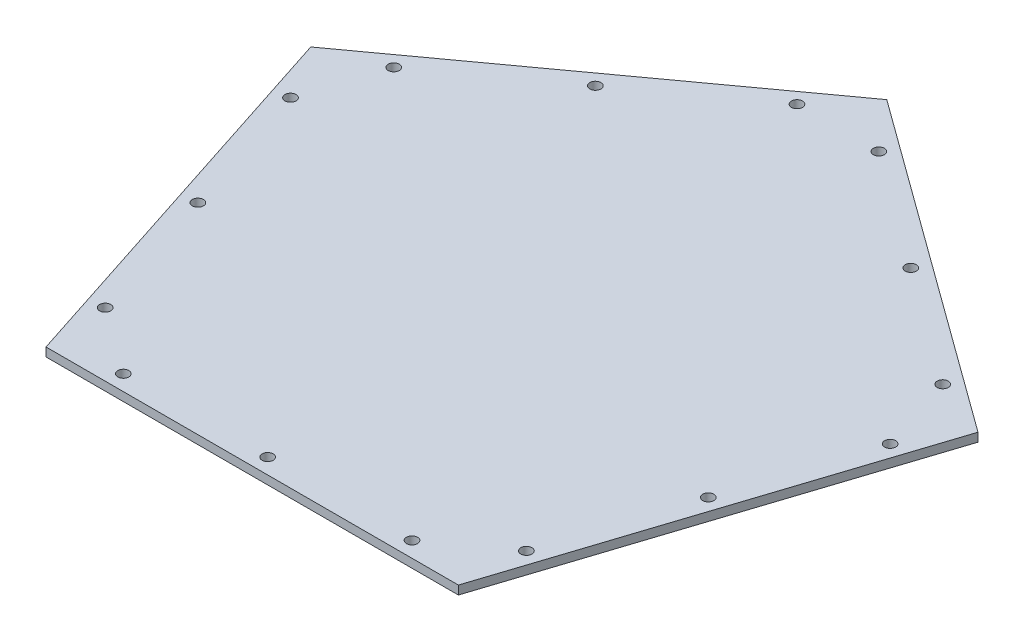
ISO-10303-21;
HEADER;
FILE_DESCRIPTION(('STEP AP214'),'2;1');
FILE_NAME('part.step','',(''),(''),'','','');
FILE_SCHEMA(('AUTOMOTIVE_DESIGN { 1 0 10303 214 1 1 1 1 }'));
ENDSEC;
DATA;
#1=APPLICATION_CONTEXT('core data for automotive mechanical design processes');
#2=APPLICATION_PROTOCOL_DEFINITION('international standard','automotive_design',2000,#1);
#3=PRODUCT_CONTEXT('',#1,'mechanical');
#4=PRODUCT('Part','Part','',(#3));
#5=PRODUCT_RELATED_PRODUCT_CATEGORY('part','',(#4));
#6=PRODUCT_DEFINITION_FORMATION('','',#4);
#7=PRODUCT_DEFINITION_CONTEXT('part definition',#1,'design');
#8=PRODUCT_DEFINITION('design','',#6,#7);
#9=PRODUCT_DEFINITION_SHAPE('','',#8);
#10=(LENGTH_UNIT() NAMED_UNIT(*) SI_UNIT(.MILLI.,.METRE.));
#11=(NAMED_UNIT(*) PLANE_ANGLE_UNIT() SI_UNIT($,.RADIAN.));
#12=(NAMED_UNIT(*) SI_UNIT($,.STERADIAN.) SOLID_ANGLE_UNIT());
#13=UNCERTAINTY_MEASURE_WITH_UNIT(LENGTH_MEASURE(1.E-05),#10,'distance_accuracy_value','');
#14=(GEOMETRIC_REPRESENTATION_CONTEXT(3) GLOBAL_UNCERTAINTY_ASSIGNED_CONTEXT((#13)) GLOBAL_UNIT_ASSIGNED_CONTEXT((#10,
#11,#12)) REPRESENTATION_CONTEXT('',''));
#15=CARTESIAN_POINT('',(0.,0.,0.));
#16=DIRECTION('',(0.,0.,1.));
#17=DIRECTION('',(1.,0.,0.));
#18=AXIS2_PLACEMENT_3D('',#15,#16,#17);
#19=CARTESIAN_POINT('',(63.5,1.3335,87.4002519499193));
#20=DIRECTION('',(0.,0.,-1.));
#21=DIRECTION('',(-1.,0.,0.));
#22=AXIS2_PLACEMENT_3D('',#19,#20,#21);
#23=PLANE('',#22);
#24=DIRECTION('',(1.,0.,0.));
#25=VECTOR('',#24,1.);
#26=CARTESIAN_POINT('',(63.5,-1.3335,87.4002519499193));
#27=LINE('',#26,#25);
#28=CARTESIAN_POINT('',(-63.4999999999988,-1.3335,87.4002519499202));
#29=VERTEX_POINT('',#28);
#30=CARTESIAN_POINT('',(63.5,-1.3335,87.4002519499193));
#31=VERTEX_POINT('',#30);
#32=EDGE_CURVE('E103',#29,#31,#27,.T.);
#33=ORIENTED_EDGE('',*,*,#32,.T.);
#34=DIRECTION('',(0.,-1.,0.));
#35=VECTOR('',#34,1.);
#36=CARTESIAN_POINT('',(63.5,1.3335,87.4002519499193));
#37=LINE('',#36,#35);
#38=CARTESIAN_POINT('',(63.5,1.3335,87.4002519499193));
#39=VERTEX_POINT('',#38);
#40=EDGE_CURVE('E47',#39,#31,#37,.T.);
#41=ORIENTED_EDGE('',*,*,#40,.F.);
#42=DIRECTION('',(1.,0.,0.));
#43=VECTOR('',#42,1.);
#44=CARTESIAN_POINT('',(-63.5,1.3335,87.4002519499193));
#45=LINE('',#44,#43);
#46=CARTESIAN_POINT('',(-63.5,1.3335,87.4002519499193));
#47=VERTEX_POINT('',#46);
#48=EDGE_CURVE('E57',#47,#39,#45,.T.);
#49=ORIENTED_EDGE('',*,*,#48,.F.);
#50=DIRECTION('',(0.,-1.,0.));
#51=VECTOR('',#50,1.);
#52=CARTESIAN_POINT('',(-63.5,1.3335,87.4002519499193));
#53=LINE('',#52,#51);
#54=EDGE_CURVE('E11',#47,#29,#53,.T.);
#55=ORIENTED_EDGE('',*,*,#54,.T.);
#56=EDGE_LOOP('',(#33,#41,#49,#55));
#57=FACE_BOUND('',#56,.T.);
#58=ADVANCED_FACE('F38',(#57),#23,.F.);
#59=CARTESIAN_POINT('',(0.,1.3335,0.));
#60=DIRECTION('',(0.,-1.,0.));
#61=DIRECTION('',(0.,0.,-1.));
#62=AXIS2_PLACEMENT_3D('',#59,#60,#61);
#63=PLANE('',#62);
#64=CARTESIAN_POINT('',(78.5931724839533,1.3335,25.5364697294663));
#65=DIRECTION('',(0.,-1.,0.));
#66=DIRECTION('',(-0.951056516295155,0.,-0.309016994374945));
#67=AXIS2_PLACEMENT_3D('',#64,#65,#66);
#68=CIRCLE('',#67,1.7145);
#69=CARTESIAN_POINT('',(76.9625860867653,1.3335,25.0066600926104));
#70=VERTEX_POINT('',#69);
#71=EDGE_CURVE('E321',#70,#70,#68,.T.);
#72=ORIENTED_EDGE('',*,*,#71,.T.);
#73=EDGE_LOOP('',(#72));
#74=FACE_BOUND('',#73,.T.);
#75=CARTESIAN_POINT('',(92.3289778839196,1.3335,-16.7379924198533));
#76=DIRECTION('',(0.,-1.,0.));
#77=DIRECTION('',(-0.951056516295155,0.,-0.309016994374945));
#78=AXIS2_PLACEMENT_3D('',#75,#76,#77);
#79=CIRCLE('',#78,1.7145);
#80=CARTESIAN_POINT('',(90.6983914867316,1.3335,-17.2678020567092));
#81=VERTEX_POINT('',#80);
#82=EDGE_CURVE('E323',#81,#81,#79,.T.);
#83=ORIENTED_EDGE('',*,*,#82,.T.);
#84=EDGE_LOOP('',(#83));
#85=FACE_BOUND('',#84,.T.);
#86=CARTESIAN_POINT('',(84.5340572787323,1.3335,-40.7282912400262));
#87=DIRECTION('',(0.,-1.,0.));
#88=DIRECTION('',(-0.587785252292469,0.,0.809016994374951));
#89=AXIS2_PLACEMENT_3D('',#86,#87,#88);
#90=CIRCLE('',#89,1.7145);
#91=CARTESIAN_POINT('',(83.5262994636769,1.3335,-39.3412316031703));
#92=VERTEX_POINT('',#91);
#93=EDGE_CURVE('E326',#92,#92,#90,.T.);
#94=ORIENTED_EDGE('',*,*,#93,.T.);
#95=EDGE_LOOP('',(#94));
#96=FACE_BOUND('',#95,.T.);
#97=CARTESIAN_POINT('',(48.5732518787657,1.3335,-66.8553457044264));
#98=DIRECTION('',(0.,-1.,0.));
#99=DIRECTION('',(-0.587785252292469,0.,0.809016994374951));
#100=AXIS2_PLACEMENT_3D('',#97,#98,#99);
#101=CIRCLE('',#100,1.7145);
#102=CARTESIAN_POINT('',(47.5654940637103,1.3335,-65.4682860675706));
#103=VERTEX_POINT('',#102);
#104=EDGE_CURVE('E329',#103,#103,#101,.T.);
#105=ORIENTED_EDGE('',*,*,#104,.T.);
#106=EDGE_LOOP('',(#105));
#107=FACE_BOUND('',#106,.T.);
#108=CARTESIAN_POINT('',(12.6124464787992,1.3335,-92.9824001688266));
#109=DIRECTION('',(0.,-1.,0.));
#110=DIRECTION('',(-0.587785252292469,0.,0.809016994374951));
#111=AXIS2_PLACEMENT_3D('',#108,#109,#110);
#112=CIRCLE('',#111,1.7145);
#113=CARTESIAN_POINT('',(11.6046886637437,1.3335,-91.5953405319708));
#114=VERTEX_POINT('',#113);
#115=EDGE_CURVE('E332',#114,#114,#112,.T.);
#116=ORIENTED_EDGE('',*,*,#115,.T.);
#117=EDGE_LOOP('',(#116));
#118=FACE_BOUND('',#117,.T.);
#119=CARTESIAN_POINT('',(-12.6124464788005,1.3335,-92.9824001688265));
#120=DIRECTION('',(0.,-1.,0.));
#121=DIRECTION('',(0.58778525229248,0.,0.809016994374942));
#122=AXIS2_PLACEMENT_3D('',#119,#120,#121);
#123=CIRCLE('',#122,1.7145);
#124=CARTESIAN_POINT('',(-11.6046886637451,1.3335,-91.5953405319706));
#125=VERTEX_POINT('',#124);
#126=EDGE_CURVE('E335',#125,#125,#123,.T.);
#127=ORIENTED_EDGE('',*,*,#126,.T.);
#128=EDGE_LOOP('',(#127));
#129=FACE_BOUND('',#128,.T.);
#130=CARTESIAN_POINT('',(-48.5732518787667,1.3335,-66.8553457044257));
#131=DIRECTION('',(0.,-1.,0.));
#132=DIRECTION('',(0.58778525229248,0.,0.809016994374942));
#133=AXIS2_PLACEMENT_3D('',#130,#131,#132);
#134=CIRCLE('',#133,1.7145);
#135=CARTESIAN_POINT('',(-47.5654940637112,1.3335,-65.4682860675699));
#136=VERTEX_POINT('',#135);
#137=EDGE_CURVE('E313',#136,#136,#134,.T.);
#138=ORIENTED_EDGE('',*,*,#137,.T.);
#139=EDGE_LOOP('',(#138));
#140=FACE_BOUND('',#139,.T.);
#141=CARTESIAN_POINT('',(-84.5340572787329,1.3335,-40.728291240025));
#142=DIRECTION('',(0.,-1.,0.));
#143=DIRECTION('',(0.58778525229248,0.,0.809016994374942));
#144=AXIS2_PLACEMENT_3D('',#141,#142,#143);
#145=CIRCLE('',#144,1.7145);
#146=CARTESIAN_POINT('',(-83.5262994636774,1.3335,-39.3412316031691));
#147=VERTEX_POINT('',#146);
#148=EDGE_CURVE('E309',#147,#147,#145,.T.);
#149=ORIENTED_EDGE('',*,*,#148,.T.);
#150=EDGE_LOOP('',(#149));
#151=FACE_BOUND('',#150,.T.);
#152=CARTESIAN_POINT('',(-92.3289778839199,1.3335,-16.737992419852));
#153=DIRECTION('',(0.,-1.,0.));
#154=DIRECTION('',(0.95105651629515,0.,-0.309016994374958));
#155=AXIS2_PLACEMENT_3D('',#152,#153,#154);
#156=CIRCLE('',#155,1.7145);
#157=CARTESIAN_POINT('',(-90.6983914867318,1.3335,-17.2678020567079));
#158=VERTEX_POINT('',#157);
#159=EDGE_CURVE('E307',#158,#158,#156,.T.);
#160=ORIENTED_EDGE('',*,*,#159,.T.);
#161=EDGE_LOOP('',(#160));
#162=FACE_BOUND('',#161,.T.);
#163=CARTESIAN_POINT('',(-78.593172483953,1.3335,25.5364697294674));
#164=DIRECTION('',(0.,-1.,0.));
#165=DIRECTION('',(0.95105651629515,0.,-0.309016994374958));
#166=AXIS2_PLACEMENT_3D('',#163,#164,#165);
#167=CIRCLE('',#166,1.7145);
#168=CARTESIAN_POINT('',(-76.9625860867649,1.3335,25.0066600926115));
#169=VERTEX_POINT('',#168);
#170=EDGE_CURVE('E310',#169,#169,#167,.T.);
#171=ORIENTED_EDGE('',*,*,#170,.T.);
#172=EDGE_LOOP('',(#171));
#173=FACE_BOUND('',#172,.T.);
#174=CARTESIAN_POINT('',(-64.8573670839861,1.3335,67.8109318787868));
#175=DIRECTION('',(0.,-1.,0.));
#176=DIRECTION('',(0.95105651629515,0.,-0.309016994374958));
#177=AXIS2_PLACEMENT_3D('',#174,#175,#176);
#178=CIRCLE('',#177,1.7145);
#179=CARTESIAN_POINT('',(-63.226780686798,1.3335,67.281122241931));
#180=VERTEX_POINT('',#179);
#181=EDGE_CURVE('E316',#180,#180,#178,.T.);
#182=ORIENTED_EDGE('',*,*,#181,.T.);
#183=EDGE_LOOP('',(#182));
#184=FACE_BOUND('',#183,.T.);
#185=CARTESIAN_POINT('',(64.857367083987,1.3335,67.8109318787859));
#186=DIRECTION('',(0.,-1.,0.));
#187=DIRECTION('',(-0.951056516295155,0.,-0.309016994374945));
#188=AXIS2_PLACEMENT_3D('',#185,#186,#187);
#189=CIRCLE('',#188,1.7145);
#190=CARTESIAN_POINT('',(63.226780686799,1.3335,67.2811222419301));
#191=VERTEX_POINT('',#190);
#192=EDGE_CURVE('E157',#191,#191,#189,.T.);
#193=ORIENTED_EDGE('',*,*,#192,.T.);
#194=EDGE_LOOP('',(#193));
#195=FACE_BOUND('',#194,.T.);
#196=CARTESIAN_POINT('',(-44.45,1.3335,82.6377519499193));
#197=DIRECTION('',(0.,-1.,0.));
#198=DIRECTION('',(0.,0.,-1.));
#199=AXIS2_PLACEMENT_3D('',#196,#197,#198);
#200=CIRCLE('',#199,1.7145);
#201=CARTESIAN_POINT('',(-44.45,1.3335,80.9232519499193));
#202=VERTEX_POINT('',#201);
#203=EDGE_CURVE('E126',#202,#202,#200,.T.);
#204=ORIENTED_EDGE('',*,*,#203,.T.);
#205=EDGE_LOOP('',(#204));
#206=FACE_BOUND('',#205,.T.);
#207=CARTESIAN_POINT('',(0.,1.3335,82.6377519499193));
#208=DIRECTION('',(0.,-1.,0.));
#209=DIRECTION('',(0.,0.,-1.));
#210=AXIS2_PLACEMENT_3D('',#207,#208,#209);
#211=CIRCLE('',#210,1.7145);
#212=CARTESIAN_POINT('',(0.,1.3335,80.9232519499193));
#213=VERTEX_POINT('',#212);
#214=EDGE_CURVE('E130',#213,#213,#211,.T.);
#215=ORIENTED_EDGE('',*,*,#214,.T.);
#216=EDGE_LOOP('',(#215));
#217=FACE_BOUND('',#216,.T.);
#218=CARTESIAN_POINT('',(44.45,1.3335,82.6377519499193));
#219=DIRECTION('',(0.,-1.,0.));
#220=DIRECTION('',(0.,0.,-1.));
#221=AXIS2_PLACEMENT_3D('',#218,#219,#220);
#222=CIRCLE('',#221,1.7145);
#223=CARTESIAN_POINT('',(44.45,1.3335,80.9232519499193));
#224=VERTEX_POINT('',#223);
#225=EDGE_CURVE('E125',#224,#224,#222,.T.);
#226=ORIENTED_EDGE('',*,*,#225,.T.);
#227=EDGE_LOOP('',(#226));
#228=FACE_BOUND('',#227,.T.);
#229=ORIENTED_EDGE('',*,*,#48,.T.);
#230=DIRECTION('',(0.309016994374945,0.,-0.951056516295155));
#231=VECTOR('',#230,1.);
#232=CARTESIAN_POINT('',(63.5,1.3335,87.4002519499193));
#233=LINE('',#232,#231);
#234=CARTESIAN_POINT('',(102.745158285618,1.3335,-33.3839256195654));
#235=VERTEX_POINT('',#234);
#236=EDGE_CURVE('E117',#39,#235,#233,.T.);
#237=ORIENTED_EDGE('',*,*,#236,.T.);
#238=DIRECTION('',(-0.809016994374951,0.,-0.587785252292469));
#239=VECTOR('',#238,1.);
#240=CARTESIAN_POINT('',(102.745158285618,1.3335,-33.3839256195654));
#241=LINE('',#240,#239);
#242=CARTESIAN_POINT('',(-7.63278329429795E-13,1.3335,-108.032652660709));
#243=VERTEX_POINT('',#242);
#244=EDGE_CURVE('E110',#235,#243,#241,.T.);
#245=ORIENTED_EDGE('',*,*,#244,.T.);
#246=DIRECTION('',(-0.809016994374942,0.,0.58778525229248));
#247=VECTOR('',#246,1.);
#248=CARTESIAN_POINT('',(-7.97972798949331E-13,1.3335,-108.032652660709));
#249=LINE('',#248,#247);
#250=CARTESIAN_POINT('',(-102.745158285618,1.3335,-33.3839256195639));
#251=VERTEX_POINT('',#250);
#252=EDGE_CURVE('E94',#243,#251,#249,.T.);
#253=ORIENTED_EDGE('',*,*,#252,.T.);
#254=DIRECTION('',(0.309016994374958,0.,0.95105651629515));
#255=VECTOR('',#254,1.);
#256=CARTESIAN_POINT('',(-102.745158285618,1.3335,-33.3839256195639));
#257=LINE('',#256,#255);
#258=EDGE_CURVE('E95',#251,#47,#257,.T.);
#259=ORIENTED_EDGE('',*,*,#258,.T.);
#260=EDGE_LOOP('',(#229,#237,#245,#253,#259));
#261=FACE_BOUND('',#260,.T.);
#262=ADVANCED_FACE('F196',(#74,#85,#96,#107,#118,#129,#140,#151,#162,#173,#184,#195,#206,#217,
#228,#261),#63,.F.);
#263=CARTESIAN_POINT('',(0.,-1.3335,0.));
#264=DIRECTION('',(0.,-1.,0.));
#265=DIRECTION('',(0.,0.,-1.));
#266=AXIS2_PLACEMENT_3D('',#263,#264,#265);
#267=PLANE('',#266);
#268=CARTESIAN_POINT('',(78.5931724839533,-1.3335,25.5364697294663));
#269=DIRECTION('',(0.,-1.,0.));
#270=DIRECTION('',(0.,0.,-1.));
#271=AXIS2_PLACEMENT_3D('',#268,#269,#270);
#272=CIRCLE('',#271,1.7145);
#273=CARTESIAN_POINT('',(78.5931724839533,-1.3335,23.8219697294663));
#274=VERTEX_POINT('',#273);
#275=EDGE_CURVE('E41',#274,#274,#272,.T.);
#276=ORIENTED_EDGE('',*,*,#275,.F.);
#277=EDGE_LOOP('',(#276));
#278=FACE_BOUND('',#277,.T.);
#279=CARTESIAN_POINT('',(92.3289778839196,-1.3335,-16.7379924198533));
#280=DIRECTION('',(0.,-1.,0.));
#281=DIRECTION('',(0.,0.,-1.));
#282=AXIS2_PLACEMENT_3D('',#279,#280,#281);
#283=CIRCLE('',#282,1.7145);
#284=CARTESIAN_POINT('',(92.3289778839196,-1.3335,-18.4524924198533));
#285=VERTEX_POINT('',#284);
#286=EDGE_CURVE('E183',#285,#285,#283,.T.);
#287=ORIENTED_EDGE('',*,*,#286,.F.);
#288=EDGE_LOOP('',(#287));
#289=FACE_BOUND('',#288,.T.);
#290=CARTESIAN_POINT('',(84.5340572787323,-1.3335,-40.7282912400262));
#291=DIRECTION('',(0.,-1.,0.));
#292=DIRECTION('',(0.,0.,-1.));
#293=AXIS2_PLACEMENT_3D('',#290,#291,#292);
#294=CIRCLE('',#293,1.7145);
#295=CARTESIAN_POINT('',(84.5340572787323,-1.3335,-42.4427912400262));
#296=VERTEX_POINT('',#295);
#297=EDGE_CURVE('E181',#296,#296,#294,.T.);
#298=ORIENTED_EDGE('',*,*,#297,.F.);
#299=EDGE_LOOP('',(#298));
#300=FACE_BOUND('',#299,.T.);
#301=CARTESIAN_POINT('',(48.5732518787657,-1.3335,-66.8553457044264));
#302=DIRECTION('',(0.,-1.,0.));
#303=DIRECTION('',(0.,0.,-1.));
#304=AXIS2_PLACEMENT_3D('',#301,#302,#303);
#305=CIRCLE('',#304,1.7145);
#306=CARTESIAN_POINT('',(48.5732518787657,-1.3335,-68.5698457044264));
#307=VERTEX_POINT('',#306);
#308=EDGE_CURVE('E178',#307,#307,#305,.T.);
#309=ORIENTED_EDGE('',*,*,#308,.F.);
#310=EDGE_LOOP('',(#309));
#311=FACE_BOUND('',#310,.T.);
#312=CARTESIAN_POINT('',(12.6124464787992,-1.3335,-92.9824001688266));
#313=DIRECTION('',(0.,-1.,0.));
#314=DIRECTION('',(0.,0.,-1.));
#315=AXIS2_PLACEMENT_3D('',#312,#313,#314);
#316=CIRCLE('',#315,1.7145);
#317=CARTESIAN_POINT('',(12.6124464787992,-1.3335,-94.6969001688266));
#318=VERTEX_POINT('',#317);
#319=EDGE_CURVE('E175',#318,#318,#316,.T.);
#320=ORIENTED_EDGE('',*,*,#319,.F.);
#321=EDGE_LOOP('',(#320));
#322=FACE_BOUND('',#321,.T.);
#323=CARTESIAN_POINT('',(-12.6124464788005,-1.3335,-92.9824001688265));
#324=DIRECTION('',(0.,-1.,0.));
#325=DIRECTION('',(0.,0.,-1.));
#326=AXIS2_PLACEMENT_3D('',#323,#324,#325);
#327=CIRCLE('',#326,1.7145);
#328=CARTESIAN_POINT('',(-12.6124464788005,-1.3335,-94.6969001688265));
#329=VERTEX_POINT('',#328);
#330=EDGE_CURVE('E172',#329,#329,#327,.T.);
#331=ORIENTED_EDGE('',*,*,#330,.F.);
#332=EDGE_LOOP('',(#331));
#333=FACE_BOUND('',#332,.T.);
#334=CARTESIAN_POINT('',(-48.5732518787667,-1.3335,-66.8553457044257));
#335=DIRECTION('',(0.,-1.,0.));
#336=DIRECTION('',(0.,0.,-1.));
#337=AXIS2_PLACEMENT_3D('',#334,#335,#336);
#338=CIRCLE('',#337,1.7145);
#339=CARTESIAN_POINT('',(-48.5732518787667,-1.3335,-68.5698457044257));
#340=VERTEX_POINT('',#339);
#341=EDGE_CURVE('E169',#340,#340,#338,.T.);
#342=ORIENTED_EDGE('',*,*,#341,.F.);
#343=EDGE_LOOP('',(#342));
#344=FACE_BOUND('',#343,.T.);
#345=CARTESIAN_POINT('',(-84.5340572787329,-1.3335,-40.728291240025));
#346=DIRECTION('',(0.,-1.,0.));
#347=DIRECTION('',(0.,0.,-1.));
#348=AXIS2_PLACEMENT_3D('',#345,#346,#347);
#349=CIRCLE('',#348,1.7145);
#350=CARTESIAN_POINT('',(-84.5340572787329,-1.3335,-42.442791240025));
#351=VERTEX_POINT('',#350);
#352=EDGE_CURVE('E166',#351,#351,#349,.T.);
#353=ORIENTED_EDGE('',*,*,#352,.F.);
#354=EDGE_LOOP('',(#353));
#355=FACE_BOUND('',#354,.T.);
#356=CARTESIAN_POINT('',(-92.3289778839199,-1.3335,-16.737992419852));
#357=DIRECTION('',(0.,-1.,0.));
#358=DIRECTION('',(0.,0.,-1.));
#359=AXIS2_PLACEMENT_3D('',#356,#357,#358);
#360=CIRCLE('',#359,1.7145);
#361=CARTESIAN_POINT('',(-92.3289778839199,-1.3335,-18.452492419852));
#362=VERTEX_POINT('',#361);
#363=EDGE_CURVE('E163',#362,#362,#360,.T.);
#364=ORIENTED_EDGE('',*,*,#363,.F.);
#365=EDGE_LOOP('',(#364));
#366=FACE_BOUND('',#365,.T.);
#367=CARTESIAN_POINT('',(-78.593172483953,-1.3335,25.5364697294674));
#368=DIRECTION('',(0.,-1.,0.));
#369=DIRECTION('',(0.,0.,-1.));
#370=AXIS2_PLACEMENT_3D('',#367,#368,#369);
#371=CIRCLE('',#370,1.7145);
#372=CARTESIAN_POINT('',(-78.593172483953,-1.3335,23.8219697294674));
#373=VERTEX_POINT('',#372);
#374=EDGE_CURVE('E160',#373,#373,#371,.T.);
#375=ORIENTED_EDGE('',*,*,#374,.F.);
#376=EDGE_LOOP('',(#375));
#377=FACE_BOUND('',#376,.T.);
#378=CARTESIAN_POINT('',(-64.8573670839861,-1.3335,67.8109318787868));
#379=DIRECTION('',(0.,-1.,0.));
#380=DIRECTION('',(0.,0.,-1.));
#381=AXIS2_PLACEMENT_3D('',#378,#379,#380);
#382=CIRCLE('',#381,1.7145);
#383=CARTESIAN_POINT('',(-64.8573670839861,-1.3335,66.0964318787868));
#384=VERTEX_POINT('',#383);
#385=EDGE_CURVE('E156',#384,#384,#382,.T.);
#386=ORIENTED_EDGE('',*,*,#385,.F.);
#387=EDGE_LOOP('',(#386));
#388=FACE_BOUND('',#387,.T.);
#389=CARTESIAN_POINT('',(64.857367083987,-1.3335,67.8109318787859));
#390=DIRECTION('',(0.,-1.,0.));
#391=DIRECTION('',(0.,0.,-1.));
#392=AXIS2_PLACEMENT_3D('',#389,#390,#391);
#393=CIRCLE('',#392,1.7145);
#394=CARTESIAN_POINT('',(64.857367083987,-1.3335,66.0964318787859));
#395=VERTEX_POINT('',#394);
#396=EDGE_CURVE('E152',#395,#395,#393,.T.);
#397=ORIENTED_EDGE('',*,*,#396,.F.);
#398=EDGE_LOOP('',(#397));
#399=FACE_BOUND('',#398,.T.);
#400=CARTESIAN_POINT('',(-44.45,-1.3335,82.6377519499193));
#401=DIRECTION('',(0.,-1.,0.));
#402=DIRECTION('',(0.,0.,-1.));
#403=AXIS2_PLACEMENT_3D('',#400,#401,#402);
#404=CIRCLE('',#403,1.7145);
#405=CARTESIAN_POINT('',(-44.45,-1.3335,80.9232519499193));
#406=VERTEX_POINT('',#405);
#407=EDGE_CURVE('E140',#406,#406,#404,.T.);
#408=ORIENTED_EDGE('',*,*,#407,.F.);
#409=EDGE_LOOP('',(#408));
#410=FACE_BOUND('',#409,.T.);
#411=CARTESIAN_POINT('',(0.,-1.3335,82.6377519499193));
#412=DIRECTION('',(0.,-1.,0.));
#413=DIRECTION('',(0.,0.,-1.));
#414=AXIS2_PLACEMENT_3D('',#411,#412,#413);
#415=CIRCLE('',#414,1.7145);
#416=CARTESIAN_POINT('',(0.,-1.3335,80.9232519499193));
#417=VERTEX_POINT('',#416);
#418=EDGE_CURVE('E147',#417,#417,#415,.T.);
#419=ORIENTED_EDGE('',*,*,#418,.F.);
#420=EDGE_LOOP('',(#419));
#421=FACE_BOUND('',#420,.T.);
#422=CARTESIAN_POINT('',(44.45,-1.3335,82.6377519499193));
#423=DIRECTION('',(0.,-1.,0.));
#424=DIRECTION('',(0.,0.,-1.));
#425=AXIS2_PLACEMENT_3D('',#422,#423,#424);
#426=CIRCLE('',#425,1.7145);
#427=CARTESIAN_POINT('',(44.45,-1.3335,80.9232519499193));
#428=VERTEX_POINT('',#427);
#429=EDGE_CURVE('E129',#428,#428,#426,.T.);
#430=ORIENTED_EDGE('',*,*,#429,.F.);
#431=EDGE_LOOP('',(#430));
#432=FACE_BOUND('',#431,.T.);
#433=DIRECTION('',(0.309016994374945,0.,-0.951056516295155));
#434=VECTOR('',#433,1.);
#435=CARTESIAN_POINT('',(102.745158285618,-1.3335,-33.3839256195654));
#436=LINE('',#435,#434);
#437=CARTESIAN_POINT('',(102.745158285618,-1.3335,-33.3839256195654));
#438=VERTEX_POINT('',#437);
#439=EDGE_CURVE('E116',#31,#438,#436,.T.);
#440=ORIENTED_EDGE('',*,*,#439,.F.);
#441=ORIENTED_EDGE('',*,*,#32,.F.);
#442=DIRECTION('',(0.309016994374958,0.,0.95105651629515));
#443=VECTOR('',#442,1.);
#444=CARTESIAN_POINT('',(-63.4999999999988,-1.3335,87.4002519499202));
#445=LINE('',#444,#443);
#446=CARTESIAN_POINT('',(-102.745158285618,-1.3335,-33.3839256195639));
#447=VERTEX_POINT('',#446);
#448=EDGE_CURVE('E99',#447,#29,#445,.T.);
#449=ORIENTED_EDGE('',*,*,#448,.F.);
#450=DIRECTION('',(-0.809016994374942,0.,0.58778525229248));
#451=VECTOR('',#450,1.);
#452=CARTESIAN_POINT('',(-102.745158285618,-1.3335,-33.3839256195639));
#453=LINE('',#452,#451);
#454=CARTESIAN_POINT('',(-7.97972798949331E-13,-1.3335,-108.032652660709));
#455=VERTEX_POINT('',#454);
#456=EDGE_CURVE('E83',#455,#447,#453,.T.);
#457=ORIENTED_EDGE('',*,*,#456,.F.);
#458=DIRECTION('',(-0.809016994374951,0.,-0.587785252292468));
#459=VECTOR('',#458,1.);
#460=CARTESIAN_POINT('',(-7.63278329429795E-13,-1.3335,-108.032652660709));
#461=LINE('',#460,#459);
#462=EDGE_CURVE('E108',#438,#455,#461,.T.);
#463=ORIENTED_EDGE('',*,*,#462,.F.);
#464=EDGE_LOOP('',(#440,#441,#449,#457,#463));
#465=FACE_BOUND('',#464,.T.);
#466=ADVANCED_FACE('F101',(#278,#289,#300,#311,#322,#333,#344,#355,#366,#377,#388,#399,#410,
#421,#432,#465),#267,.T.);
#467=CARTESIAN_POINT('',(44.45,1.3335,82.6377519499193));
#468=DIRECTION('',(0.,-1.,0.));
#469=DIRECTION('',(0.,0.,-1.));
#470=AXIS2_PLACEMENT_3D('',#467,#468,#469);
#471=CYLINDRICAL_SURFACE('',#470,1.7145);
#472=ORIENTED_EDGE('',*,*,#429,.T.);
#473=EDGE_LOOP('',(#472));
#474=FACE_BOUND('',#473,.T.);
#475=ORIENTED_EDGE('',*,*,#225,.F.);
#476=EDGE_LOOP('',(#475));
#477=FACE_BOUND('',#476,.T.);
#478=ADVANCED_FACE('F195',(#474,#477),#471,.F.);
#479=CARTESIAN_POINT('',(0.,1.3335,82.6377519499193));
#480=DIRECTION('',(0.,-1.,0.));
#481=DIRECTION('',(0.,0.,-1.));
#482=AXIS2_PLACEMENT_3D('',#479,#480,#481);
#483=CYLINDRICAL_SURFACE('',#482,1.7145);
#484=ORIENTED_EDGE('',*,*,#418,.T.);
#485=EDGE_LOOP('',(#484));
#486=FACE_BOUND('',#485,.T.);
#487=ORIENTED_EDGE('',*,*,#214,.F.);
#488=EDGE_LOOP('',(#487));
#489=FACE_BOUND('',#488,.T.);
#490=ADVANCED_FACE('F226',(#486,#489),#483,.F.);
#491=CARTESIAN_POINT('',(-44.45,1.3335,82.6377519499193));
#492=DIRECTION('',(0.,-1.,0.));
#493=DIRECTION('',(0.,0.,-1.));
#494=AXIS2_PLACEMENT_3D('',#491,#492,#493);
#495=CYLINDRICAL_SURFACE('',#494,1.7145);
#496=ORIENTED_EDGE('',*,*,#407,.T.);
#497=EDGE_LOOP('',(#496));
#498=FACE_BOUND('',#497,.T.);
#499=ORIENTED_EDGE('',*,*,#203,.F.);
#500=EDGE_LOOP('',(#499));
#501=FACE_BOUND('',#500,.T.);
#502=ADVANCED_FACE('F241',(#498,#501),#495,.F.);
#503=CARTESIAN_POINT('',(102.745158285618,1.3335,-33.3839256195654));
#504=DIRECTION('',(-0.951056516295154,0.,-0.309016994374944));
#505=DIRECTION('',(-0.309016994374945,0.,0.951056516295155));
#506=AXIS2_PLACEMENT_3D('',#503,#504,#505);
#507=PLANE('',#506);
#508=ORIENTED_EDGE('',*,*,#439,.T.);
#509=DIRECTION('',(0.,-1.,0.));
#510=VECTOR('',#509,1.);
#511=CARTESIAN_POINT('',(102.745158285618,1.3335,-33.3839256195654));
#512=LINE('',#511,#510);
#513=EDGE_CURVE('E120',#235,#438,#512,.T.);
#514=ORIENTED_EDGE('',*,*,#513,.F.);
#515=ORIENTED_EDGE('',*,*,#236,.F.);
#516=ORIENTED_EDGE('',*,*,#40,.T.);
#517=EDGE_LOOP('',(#508,#514,#515,#516));
#518=FACE_BOUND('',#517,.T.);
#519=ADVANCED_FACE('F245',(#518),#507,.F.);
#520=CARTESIAN_POINT('',(-7.63278329429795E-13,1.3335,-108.032652660709));
#521=DIRECTION('',(-0.587785252292468,0.,0.809016994374951));
#522=DIRECTION('',(0.809016994374951,0.,0.587785252292468));
#523=AXIS2_PLACEMENT_3D('',#520,#521,#522);
#524=PLANE('',#523);
#525=ORIENTED_EDGE('',*,*,#462,.T.);
#526=DIRECTION('',(0.,-1.,0.));
#527=VECTOR('',#526,1.);
#528=CARTESIAN_POINT('',(-7.63278329429795E-13,1.3335,-108.032652660709));
#529=LINE('',#528,#527);
#530=EDGE_CURVE('E91',#243,#455,#529,.T.);
#531=ORIENTED_EDGE('',*,*,#530,.F.);
#532=ORIENTED_EDGE('',*,*,#244,.F.);
#533=ORIENTED_EDGE('',*,*,#513,.T.);
#534=EDGE_LOOP('',(#525,#531,#532,#533));
#535=FACE_BOUND('',#534,.T.);
#536=ADVANCED_FACE('F249',(#535),#524,.F.);
#537=CARTESIAN_POINT('',(-102.745158285618,1.3335,-33.3839256195639));
#538=DIRECTION('',(0.58778525229248,0.,0.809016994374942));
#539=DIRECTION('',(0.809016994374942,0.,-0.58778525229248));
#540=AXIS2_PLACEMENT_3D('',#537,#538,#539);
#541=PLANE('',#540);
#542=ORIENTED_EDGE('',*,*,#456,.T.);
#543=DIRECTION('',(0.,-1.,0.));
#544=VECTOR('',#543,1.);
#545=CARTESIAN_POINT('',(-102.745158285618,1.3335,-33.3839256195639));
#546=LINE('',#545,#544);
#547=EDGE_CURVE('E88',#251,#447,#546,.T.);
#548=ORIENTED_EDGE('',*,*,#547,.F.);
#549=ORIENTED_EDGE('',*,*,#252,.F.);
#550=ORIENTED_EDGE('',*,*,#530,.T.);
#551=EDGE_LOOP('',(#542,#548,#549,#550));
#552=FACE_BOUND('',#551,.T.);
#553=ADVANCED_FACE('F85',(#552),#541,.F.);
#554=CARTESIAN_POINT('',(-63.4999999999988,1.3335,87.4002519499202));
#555=DIRECTION('',(0.95105651629515,0.,-0.309016994374958));
#556=DIRECTION('',(-0.309016994374958,0.,-0.95105651629515));
#557=AXIS2_PLACEMENT_3D('',#554,#555,#556);
#558=PLANE('',#557);
#559=ORIENTED_EDGE('',*,*,#448,.T.);
#560=ORIENTED_EDGE('',*,*,#54,.F.);
#561=ORIENTED_EDGE('',*,*,#258,.F.);
#562=ORIENTED_EDGE('',*,*,#547,.T.);
#563=EDGE_LOOP('',(#559,#560,#561,#562));
#564=FACE_BOUND('',#563,.T.);
#565=ADVANCED_FACE('F107',(#564),#558,.F.);
#566=CARTESIAN_POINT('',(64.857367083987,1.3335,67.8109318787859));
#567=DIRECTION('',(0.,-1.,0.));
#568=DIRECTION('',(0.,0.,-1.));
#569=AXIS2_PLACEMENT_3D('',#566,#567,#568);
#570=CYLINDRICAL_SURFACE('',#569,1.7145);
#571=ORIENTED_EDGE('',*,*,#396,.T.);
#572=EDGE_LOOP('',(#571));
#573=FACE_BOUND('',#572,.T.);
#574=ORIENTED_EDGE('',*,*,#192,.F.);
#575=EDGE_LOOP('',(#574));
#576=FACE_BOUND('',#575,.T.);
#577=ADVANCED_FACE('F258',(#573,#576),#570,.F.);
#578=CARTESIAN_POINT('',(-64.8573670839861,1.3335,67.8109318787868));
#579=DIRECTION('',(0.,-1.,0.));
#580=DIRECTION('',(0.,0.,-1.));
#581=AXIS2_PLACEMENT_3D('',#578,#579,#580);
#582=CYLINDRICAL_SURFACE('',#581,1.7145);
#583=ORIENTED_EDGE('',*,*,#385,.T.);
#584=EDGE_LOOP('',(#583));
#585=FACE_BOUND('',#584,.T.);
#586=ORIENTED_EDGE('',*,*,#181,.F.);
#587=EDGE_LOOP('',(#586));
#588=FACE_BOUND('',#587,.T.);
#589=ADVANCED_FACE('F261',(#585,#588),#582,.F.);
#590=CARTESIAN_POINT('',(-78.593172483953,1.3335,25.5364697294674));
#591=DIRECTION('',(0.,-1.,0.));
#592=DIRECTION('',(0.,0.,-1.));
#593=AXIS2_PLACEMENT_3D('',#590,#591,#592);
#594=CYLINDRICAL_SURFACE('',#593,1.7145);
#595=ORIENTED_EDGE('',*,*,#374,.T.);
#596=EDGE_LOOP('',(#595));
#597=FACE_BOUND('',#596,.T.);
#598=ORIENTED_EDGE('',*,*,#170,.F.);
#599=EDGE_LOOP('',(#598));
#600=FACE_BOUND('',#599,.T.);
#601=ADVANCED_FACE('F295',(#597,#600),#594,.F.);
#602=CARTESIAN_POINT('',(-92.3289778839199,1.3335,-16.737992419852));
#603=DIRECTION('',(0.,-1.,0.));
#604=DIRECTION('',(0.,0.,-1.));
#605=AXIS2_PLACEMENT_3D('',#602,#603,#604);
#606=CYLINDRICAL_SURFACE('',#605,1.7145);
#607=ORIENTED_EDGE('',*,*,#363,.T.);
#608=EDGE_LOOP('',(#607));
#609=FACE_BOUND('',#608,.T.);
#610=ORIENTED_EDGE('',*,*,#159,.F.);
#611=EDGE_LOOP('',(#610));
#612=FACE_BOUND('',#611,.T.);
#613=ADVANCED_FACE('F267',(#609,#612),#606,.F.);
#614=CARTESIAN_POINT('',(-84.5340572787329,1.3335,-40.728291240025));
#615=DIRECTION('',(0.,-1.,0.));
#616=DIRECTION('',(0.,0.,-1.));
#617=AXIS2_PLACEMENT_3D('',#614,#615,#616);
#618=CYLINDRICAL_SURFACE('',#617,1.7145);
#619=ORIENTED_EDGE('',*,*,#352,.T.);
#620=EDGE_LOOP('',(#619));
#621=FACE_BOUND('',#620,.T.);
#622=ORIENTED_EDGE('',*,*,#148,.F.);
#623=EDGE_LOOP('',(#622));
#624=FACE_BOUND('',#623,.T.);
#625=ADVANCED_FACE('F263',(#621,#624),#618,.F.);
#626=CARTESIAN_POINT('',(-48.5732518787667,1.3335,-66.8553457044257));
#627=DIRECTION('',(0.,-1.,0.));
#628=DIRECTION('',(0.,0.,-1.));
#629=AXIS2_PLACEMENT_3D('',#626,#627,#628);
#630=CYLINDRICAL_SURFACE('',#629,1.7145);
#631=ORIENTED_EDGE('',*,*,#341,.T.);
#632=EDGE_LOOP('',(#631));
#633=FACE_BOUND('',#632,.T.);
#634=ORIENTED_EDGE('',*,*,#137,.F.);
#635=EDGE_LOOP('',(#634));
#636=FACE_BOUND('',#635,.T.);
#637=ADVANCED_FACE('F266',(#633,#636),#630,.F.);
#638=CARTESIAN_POINT('',(-12.6124464788005,1.3335,-92.9824001688265));
#639=DIRECTION('',(0.,-1.,0.));
#640=DIRECTION('',(0.,0.,-1.));
#641=AXIS2_PLACEMENT_3D('',#638,#639,#640);
#642=CYLINDRICAL_SURFACE('',#641,1.7145);
#643=ORIENTED_EDGE('',*,*,#330,.T.);
#644=EDGE_LOOP('',(#643));
#645=FACE_BOUND('',#644,.T.);
#646=ORIENTED_EDGE('',*,*,#126,.F.);
#647=EDGE_LOOP('',(#646));
#648=FACE_BOUND('',#647,.T.);
#649=ADVANCED_FACE('F271',(#645,#648),#642,.F.);
#650=CARTESIAN_POINT('',(12.6124464787992,1.3335,-92.9824001688266));
#651=DIRECTION('',(0.,-1.,0.));
#652=DIRECTION('',(0.,0.,-1.));
#653=AXIS2_PLACEMENT_3D('',#650,#651,#652);
#654=CYLINDRICAL_SURFACE('',#653,1.7145);
#655=ORIENTED_EDGE('',*,*,#319,.T.);
#656=EDGE_LOOP('',(#655));
#657=FACE_BOUND('',#656,.T.);
#658=ORIENTED_EDGE('',*,*,#115,.F.);
#659=EDGE_LOOP('',(#658));
#660=FACE_BOUND('',#659,.T.);
#661=ADVANCED_FACE('F275',(#657,#660),#654,.F.);
#662=CARTESIAN_POINT('',(48.5732518787657,1.3335,-66.8553457044264));
#663=DIRECTION('',(0.,-1.,0.));
#664=DIRECTION('',(0.,0.,-1.));
#665=AXIS2_PLACEMENT_3D('',#662,#663,#664);
#666=CYLINDRICAL_SURFACE('',#665,1.7145);
#667=ORIENTED_EDGE('',*,*,#308,.T.);
#668=EDGE_LOOP('',(#667));
#669=FACE_BOUND('',#668,.T.);
#670=ORIENTED_EDGE('',*,*,#104,.F.);
#671=EDGE_LOOP('',(#670));
#672=FACE_BOUND('',#671,.T.);
#673=ADVANCED_FACE('F279',(#669,#672),#666,.F.);
#674=CARTESIAN_POINT('',(84.5340572787323,1.3335,-40.7282912400262));
#675=DIRECTION('',(0.,-1.,0.));
#676=DIRECTION('',(0.,0.,-1.));
#677=AXIS2_PLACEMENT_3D('',#674,#675,#676);
#678=CYLINDRICAL_SURFACE('',#677,1.7145);
#679=ORIENTED_EDGE('',*,*,#297,.T.);
#680=EDGE_LOOP('',(#679));
#681=FACE_BOUND('',#680,.T.);
#682=ORIENTED_EDGE('',*,*,#93,.F.);
#683=EDGE_LOOP('',(#682));
#684=FACE_BOUND('',#683,.T.);
#685=ADVANCED_FACE('F283',(#681,#684),#678,.F.);
#686=CARTESIAN_POINT('',(92.3289778839196,1.3335,-16.7379924198533));
#687=DIRECTION('',(0.,-1.,0.));
#688=DIRECTION('',(0.,0.,-1.));
#689=AXIS2_PLACEMENT_3D('',#686,#687,#688);
#690=CYLINDRICAL_SURFACE('',#689,1.7145);
#691=ORIENTED_EDGE('',*,*,#286,.T.);
#692=EDGE_LOOP('',(#691));
#693=FACE_BOUND('',#692,.T.);
#694=ORIENTED_EDGE('',*,*,#82,.F.);
#695=EDGE_LOOP('',(#694));
#696=FACE_BOUND('',#695,.T.);
#697=ADVANCED_FACE('F287',(#693,#696),#690,.F.);
#698=CARTESIAN_POINT('',(78.5931724839533,1.3335,25.5364697294663));
#699=DIRECTION('',(0.,-1.,0.));
#700=DIRECTION('',(0.,0.,-1.));
#701=AXIS2_PLACEMENT_3D('',#698,#699,#700);
#702=CYLINDRICAL_SURFACE('',#701,1.7145);
#703=ORIENTED_EDGE('',*,*,#275,.T.);
#704=EDGE_LOOP('',(#703));
#705=FACE_BOUND('',#704,.T.);
#706=ORIENTED_EDGE('',*,*,#71,.F.);
#707=EDGE_LOOP('',(#706));
#708=FACE_BOUND('',#707,.T.);
#709=ADVANCED_FACE('F190',(#705,#708),#702,.F.);
#710=CLOSED_SHELL('',(#58,#262,#466,#478,#490,#502,#519,#536,#553,#565,#577,#589,#601,#613,#625,
#637,#649,#661,#673,#685,#697,#709));
#711=MANIFOLD_SOLID_BREP('B2',#710);
#712=ADVANCED_BREP_SHAPE_REPRESENTATION('',(#18,#711),#14);
#713=SHAPE_DEFINITION_REPRESENTATION(#9,#712);
ENDSEC;
END-ISO-10303-21;
